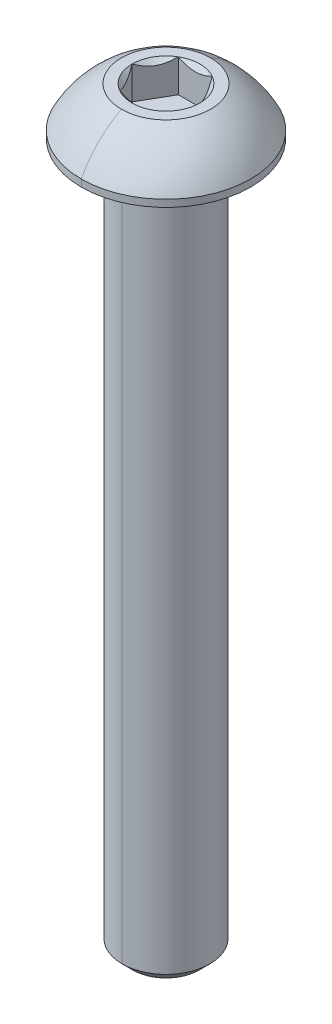
ISO-10303-21;
HEADER;
FILE_DESCRIPTION(('STEP AP214'),'2;1');
FILE_NAME('part.step','',(''),(''),'','','');
FILE_SCHEMA(('AUTOMOTIVE_DESIGN { 1 0 10303 214 1 1 1 1 }'));
ENDSEC;
DATA;
#1=APPLICATION_CONTEXT('core data for automotive mechanical design processes');
#2=APPLICATION_PROTOCOL_DEFINITION('international standard','automotive_design',2000,#1);
#3=PRODUCT_CONTEXT('',#1,'mechanical');
#4=PRODUCT('Part','Part','',(#3));
#5=PRODUCT_RELATED_PRODUCT_CATEGORY('part','',(#4));
#6=PRODUCT_DEFINITION_FORMATION('','',#4);
#7=PRODUCT_DEFINITION_CONTEXT('part definition',#1,'design');
#8=PRODUCT_DEFINITION('design','',#6,#7);
#9=PRODUCT_DEFINITION_SHAPE('','',#8);
#10=(LENGTH_UNIT() NAMED_UNIT(*) SI_UNIT(.MILLI.,.METRE.));
#11=(NAMED_UNIT(*) PLANE_ANGLE_UNIT() SI_UNIT($,.RADIAN.));
#12=(NAMED_UNIT(*) SI_UNIT($,.STERADIAN.) SOLID_ANGLE_UNIT());
#13=UNCERTAINTY_MEASURE_WITH_UNIT(LENGTH_MEASURE(1.E-05),#10,'distance_accuracy_value','');
#14=(GEOMETRIC_REPRESENTATION_CONTEXT(3) GLOBAL_UNCERTAINTY_ASSIGNED_CONTEXT((#13)) GLOBAL_UNIT_ASSIGNED_CONTEXT((#10,
#11,#12)) REPRESENTATION_CONTEXT('',''));
#15=CARTESIAN_POINT('',(0.,0.,0.));
#16=DIRECTION('',(0.,0.,1.));
#17=DIRECTION('',(1.,0.,0.));
#18=AXIS2_PLACEMENT_3D('',#15,#16,#17);
#19=CARTESIAN_POINT('',(0.,-0.152399999999997,0.));
#20=DIRECTION('',(0.,1.,0.));
#21=DIRECTION('',(0.,0.,1.));
#22=AXIS2_PLACEMENT_3D('',#19,#20,#21);
#23=TOROIDAL_SURFACE('',#22,2.5273,0.1524);
#24=CARTESIAN_POINT('',(0.,-0.152399999999997,-2.5273));
#25=DIRECTION('',(1.,0.,0.));
#26=DIRECTION('',(0.,0.,-1.));
#27=AXIS2_PLACEMENT_3D('',#24,#25,#26);
#28=CIRCLE('',#27,0.1524);
#29=CARTESIAN_POINT('',(0.,0.,-2.5273));
#30=VERTEX_POINT('',#29);
#31=CARTESIAN_POINT('',(0.,-0.152399999999997,-2.3749));
#32=VERTEX_POINT('',#31);
#33=EDGE_CURVE('E235',#30,#32,#28,.T.);
#34=ORIENTED_EDGE('',*,*,#33,.F.);
#35=CARTESIAN_POINT('',(0.,0.,0.));
#36=DIRECTION('',(0.,1.,0.));
#37=DIRECTION('',(0.,0.,1.));
#38=AXIS2_PLACEMENT_3D('',#35,#36,#37);
#39=CIRCLE('',#38,2.5273);
#40=CARTESIAN_POINT('',(0.,0.,2.5273));
#41=VERTEX_POINT('',#40);
#42=EDGE_CURVE('E229',#41,#30,#39,.T.);
#43=ORIENTED_EDGE('',*,*,#42,.F.);
#44=CARTESIAN_POINT('',(0.,-0.152399999999997,2.5273));
#45=DIRECTION('',(-1.,0.,0.));
#46=DIRECTION('',(0.,0.,1.));
#47=AXIS2_PLACEMENT_3D('',#44,#45,#46);
#48=CIRCLE('',#47,0.1524);
#49=CARTESIAN_POINT('',(0.,-0.152399999999997,2.3749));
#50=VERTEX_POINT('',#49);
#51=EDGE_CURVE('E255',#41,#50,#48,.T.);
#52=ORIENTED_EDGE('',*,*,#51,.T.);
#53=CARTESIAN_POINT('',(0.,-0.152399999999997,0.));
#54=DIRECTION('',(0.,-1.,0.));
#55=DIRECTION('',(0.,0.,1.));
#56=AXIS2_PLACEMENT_3D('',#53,#54,#55);
#57=CIRCLE('',#56,2.3749);
#58=EDGE_CURVE('E199',#32,#50,#57,.T.);
#59=ORIENTED_EDGE('',*,*,#58,.F.);
#60=EDGE_LOOP('',(#34,#43,#52,#59));
#61=FACE_BOUND('',#60,.T.);
#62=ADVANCED_FACE('F16',(#61),#23,.F.);
#63=CARTESIAN_POINT('',(0.,2.5654,0.));
#64=DIRECTION('',(0.,1.,0.));
#65=DIRECTION('',(0.,0.,1.));
#66=AXIS2_PLACEMENT_3D('',#63,#64,#65);
#67=CONICAL_SURFACE('',#66,1.83308710467706,0.78539816339745);
#68=DIRECTION('',(0.,0.707106781186546,-0.707106781186549));
#69=VECTOR('',#68,1.);
#70=CARTESIAN_POINT('',(0.,2.5654,-1.83308710467706));
#71=LINE('',#70,#69);
#72=CARTESIAN_POINT('',(0.,0.732312895322944,0.));
#73=VERTEX_POINT('',#72);
#74=CARTESIAN_POINT('',(0.,0.7874,-0.0550871046770556));
#75=VERTEX_POINT('',#74);
#76=EDGE_CURVE('E248',#73,#75,#71,.T.);
#77=ORIENTED_EDGE('',*,*,#76,.F.);
#78=DIRECTION('',(0.,0.707106781186546,0.707106781186549));
#79=VECTOR('',#78,1.);
#80=CARTESIAN_POINT('',(0.,2.5654,1.83308710467706));
#81=LINE('',#80,#79);
#82=CARTESIAN_POINT('',(0.,0.7874,0.0550871046770556));
#83=VERTEX_POINT('',#82);
#84=EDGE_CURVE('E252',#73,#83,#81,.T.);
#85=ORIENTED_EDGE('',*,*,#84,.T.);
#86=CARTESIAN_POINT('',(0.,0.7874,0.));
#87=DIRECTION('',(0.,1.,0.));
#88=DIRECTION('',(0.,0.,1.));
#89=AXIS2_PLACEMENT_3D('',#86,#87,#88);
#90=CIRCLE('',#89,0.0550871046770558);
#91=EDGE_CURVE('E220',#83,#75,#90,.T.);
#92=ORIENTED_EDGE('',*,*,#91,.T.);
#93=EDGE_LOOP('',(#77,#85,#92));
#94=FACE_BOUND('',#93,.T.);
#95=ADVANCED_FACE('F323',(#94),#67,.F.);
#96=CARTESIAN_POINT('',(1.83308710467706,0.7874,0.));
#97=DIRECTION('',(0.866025403784439,0.,-0.5));
#98=DIRECTION('',(0.,-1.,0.));
#99=AXIS2_PLACEMENT_3D('',#96,#97,#98);
#100=PLANE('',#99);
#101=DIRECTION('',(0.,1.,0.));
#102=VECTOR('',#101,1.);
#103=CARTESIAN_POINT('',(1.83308710467706,0.7874,0.));
#104=LINE('',#103,#102);
#105=CARTESIAN_POINT('',(1.83308710467706,0.7874,0.));
#106=VERTEX_POINT('',#105);
#107=CARTESIAN_POINT('',(1.83308710467706,2.5654,0.));
#108=VERTEX_POINT('',#107);
#109=EDGE_CURVE('E11',#106,#108,#104,.T.);
#110=ORIENTED_EDGE('',*,*,#109,.T.);
#111=CARTESIAN_POINT('',(1.83308710467706,2.5654,0.));
#112=CARTESIAN_POINT('',(1.58854939316106,2.32086228848399,-0.423551740712339));
#113=CARTESIAN_POINT('',(1.37650342717985,2.31981648546325,-0.790826127331817));
#114=CARTESIAN_POINT('',(1.16317917435944,2.31876437797812,-1.16031457170343));
#115=CARTESIAN_POINT('',(0.91654355233853,2.5654,-1.5875));
#116=B_SPLINE_CURVE_WITH_KNOTS('',2,(#111,#112,#113,#114,#115),.UNSPECIFIED.,.F.,.F.,(3,2,3),
(0.,0.5,1.),.UNSPECIFIED.);
#117=CARTESIAN_POINT('',(0.916543552338531,2.5654,-1.5875));
#118=VERTEX_POINT('',#117);
#119=EDGE_CURVE('E247',#108,#118,#116,.T.);
#120=ORIENTED_EDGE('',*,*,#119,.T.);
#121=DIRECTION('',(0.,1.,0.));
#122=VECTOR('',#121,1.);
#123=CARTESIAN_POINT('',(0.916543552338531,0.7874,-1.5875));
#124=LINE('',#123,#122);
#125=CARTESIAN_POINT('',(0.916543552338531,0.7874,-1.5875));
#126=VERTEX_POINT('',#125);
#127=EDGE_CURVE('E222',#126,#118,#124,.T.);
#128=ORIENTED_EDGE('',*,*,#127,.F.);
#129=DIRECTION('',(-0.5,0.,-0.866025403784439));
#130=VECTOR('',#129,1.);
#131=CARTESIAN_POINT('',(1.83308710467706,0.7874,0.));
#132=LINE('',#131,#130);
#133=EDGE_CURVE('E242',#106,#126,#132,.T.);
#134=ORIENTED_EDGE('',*,*,#133,.F.);
#135=EDGE_LOOP('',(#110,#120,#128,#134));
#136=FACE_BOUND('',#135,.T.);
#137=ADVANCED_FACE('F312',(#136),#100,.F.);
#138=CARTESIAN_POINT('',(0.916543552338531,0.7874,1.5875));
#139=DIRECTION('',(0.866025403784439,0.,0.5));
#140=DIRECTION('',(0.,-1.,0.));
#141=AXIS2_PLACEMENT_3D('',#138,#139,#140);
#142=PLANE('',#141);
#143=DIRECTION('',(0.,1.,0.));
#144=VECTOR('',#143,1.);
#145=CARTESIAN_POINT('',(0.916543552338531,0.7874,1.5875));
#146=LINE('',#145,#144);
#147=CARTESIAN_POINT('',(0.916543552338531,0.7874,1.5875));
#148=VERTEX_POINT('',#147);
#149=CARTESIAN_POINT('',(0.916543552338531,2.5654,1.5875));
#150=VERTEX_POINT('',#149);
#151=EDGE_CURVE('E29',#148,#150,#146,.T.);
#152=ORIENTED_EDGE('',*,*,#151,.T.);
#153=CARTESIAN_POINT('',(0.916543552338531,2.5654,1.5875));
#154=CARTESIAN_POINT('',(1.16108126385472,2.32086228848382,1.16394825928734));
#155=CARTESIAN_POINT('',(1.37312722983574,2.31981648546325,0.796673872668184));
#156=CARTESIAN_POINT('',(1.58645148265633,2.3187643779783,0.427185428296259));
#157=CARTESIAN_POINT('',(1.83308710467706,2.5654,0.));
#158=B_SPLINE_CURVE_WITH_KNOTS('',2,(#153,#154,#155,#156,#157),.UNSPECIFIED.,.F.,.F.,(3,2,3),
(0.,0.5,1.),.UNSPECIFIED.);
#159=EDGE_CURVE('E567',#150,#108,#158,.T.);
#160=ORIENTED_EDGE('',*,*,#159,.T.);
#161=ORIENTED_EDGE('',*,*,#109,.F.);
#162=DIRECTION('',(0.5,0.,-0.866025403784439));
#163=VECTOR('',#162,1.);
#164=CARTESIAN_POINT('',(0.916543552338531,0.7874,1.5875));
#165=LINE('',#164,#163);
#166=EDGE_CURVE('E223',#148,#106,#165,.T.);
#167=ORIENTED_EDGE('',*,*,#166,.F.);
#168=EDGE_LOOP('',(#152,#160,#161,#167));
#169=FACE_BOUND('',#168,.T.);
#170=ADVANCED_FACE('F322',(#169),#142,.F.);
#171=CARTESIAN_POINT('',(-0.91654355233853,0.7874,1.5875));
#172=DIRECTION('',(0.,0.,1.));
#173=DIRECTION('',(1.,0.,0.));
#174=AXIS2_PLACEMENT_3D('',#171,#172,#173);
#175=PLANE('',#174);
#176=DIRECTION('',(0.,1.,0.));
#177=VECTOR('',#176,1.);
#178=CARTESIAN_POINT('',(-0.91654355233853,0.7874,1.5875));
#179=LINE('',#178,#177);
#180=CARTESIAN_POINT('',(-0.91654355233853,0.7874,1.5875));
#181=VERTEX_POINT('',#180);
#182=CARTESIAN_POINT('',(-0.91654355233853,2.5654,1.5875));
#183=VERTEX_POINT('',#182);
#184=EDGE_CURVE('E451',#181,#183,#179,.T.);
#185=ORIENTED_EDGE('',*,*,#184,.T.);
#186=CARTESIAN_POINT('',(-0.916543552338531,2.5654,1.5875));
#187=CARTESIAN_POINT('',(-0.684381010738564,2.44931872920002,1.5875));
#188=CARTESIAN_POINT('',(-0.4718738638875,2.38845938444161,1.5875));
#189=CARTESIAN_POINT('',(-0.232175759974894,2.31981289532294,1.5875));
#190=CARTESIAN_POINT('',(0.,2.31981289532294,1.5875));
#191=B_SPLINE_CURVE_WITH_KNOTS('',2,(#186,#187,#188,#189,#190),.UNSPECIFIED.,.F.,.F.,(3,2,3),
(0.,0.5,1.),.UNSPECIFIED.);
#192=CARTESIAN_POINT('',(0.,2.31981289532294,1.5875));
#193=VERTEX_POINT('',#192);
#194=EDGE_CURVE('E447',#183,#193,#191,.T.);
#195=ORIENTED_EDGE('',*,*,#194,.T.);
#196=CARTESIAN_POINT('',(0.,2.31981289532294,1.5875));
#197=CARTESIAN_POINT('',(0.229732695645398,2.31981289532294,1.5875));
#198=CARTESIAN_POINT('',(0.471961624215038,2.3884843914945,1.5875));
#199=CARTESIAN_POINT('',(0.68154594324368,2.44790119545257,1.5875));
#200=CARTESIAN_POINT('',(0.91654355233853,2.5654,1.5875));
#201=B_SPLINE_CURVE_WITH_KNOTS('',2,(#196,#197,#198,#199,#200),.UNSPECIFIED.,.F.,.F.,(3,2,3),
(0.,0.5,1.),.UNSPECIFIED.);
#202=EDGE_CURVE('E417',#193,#150,#201,.T.);
#203=ORIENTED_EDGE('',*,*,#202,.T.);
#204=ORIENTED_EDGE('',*,*,#151,.F.);
#205=DIRECTION('',(1.,0.,0.));
#206=VECTOR('',#205,1.);
#207=CARTESIAN_POINT('',(-0.91654355233853,0.7874,1.5875));
#208=LINE('',#207,#206);
#209=EDGE_CURVE('E260',#181,#148,#208,.T.);
#210=ORIENTED_EDGE('',*,*,#209,.F.);
#211=EDGE_LOOP('',(#185,#195,#203,#204,#210));
#212=FACE_BOUND('',#211,.T.);
#213=ADVANCED_FACE('F344',(#212),#175,.F.);
#214=CARTESIAN_POINT('',(-1.83308710467706,0.7874,0.));
#215=DIRECTION('',(-0.866025403784439,0.,0.5));
#216=DIRECTION('',(0.,1.,0.));
#217=AXIS2_PLACEMENT_3D('',#214,#215,#216);
#218=PLANE('',#217);
#219=DIRECTION('',(0.,1.,0.));
#220=VECTOR('',#219,1.);
#221=CARTESIAN_POINT('',(-1.83308710467706,0.7874,0.));
#222=LINE('',#221,#220);
#223=CARTESIAN_POINT('',(-1.83308710467706,0.7874,0.));
#224=VERTEX_POINT('',#223);
#225=CARTESIAN_POINT('',(-1.83308710467706,2.5654,0.));
#226=VERTEX_POINT('',#225);
#227=EDGE_CURVE('E370',#224,#226,#222,.T.);
#228=ORIENTED_EDGE('',*,*,#227,.T.);
#229=CARTESIAN_POINT('',(-1.83308710467706,2.5654,0.));
#230=CARTESIAN_POINT('',(-1.58854939316106,2.32086228848399,0.423551740712331));
#231=CARTESIAN_POINT('',(-1.37650342717985,2.31981648546325,0.790826127331817));
#232=CARTESIAN_POINT('',(-1.16317917435944,2.31876437797812,1.16031457170343));
#233=CARTESIAN_POINT('',(-0.91654355233853,2.5654,1.5875));
#234=B_SPLINE_CURVE_WITH_KNOTS('',2,(#229,#230,#231,#232,#233),.UNSPECIFIED.,.F.,.F.,(3,2,3),
(0.,0.5,1.),.UNSPECIFIED.);
#235=EDGE_CURVE('E364',#226,#183,#234,.T.);
#236=ORIENTED_EDGE('',*,*,#235,.T.);
#237=ORIENTED_EDGE('',*,*,#184,.F.);
#238=DIRECTION('',(0.5,0.,0.866025403784438));
#239=VECTOR('',#238,1.);
#240=CARTESIAN_POINT('',(-1.83308710467706,0.7874,0.));
#241=LINE('',#240,#239);
#242=EDGE_CURVE('E256',#224,#181,#241,.T.);
#243=ORIENTED_EDGE('',*,*,#242,.F.);
#244=EDGE_LOOP('',(#228,#236,#237,#243));
#245=FACE_BOUND('',#244,.T.);
#246=ADVANCED_FACE('F340',(#245),#218,.F.);
#247=CARTESIAN_POINT('',(-0.916543552338531,0.7874,-1.5875));
#248=DIRECTION('',(-0.866025403784439,0.,-0.5));
#249=DIRECTION('',(-0.5,0.,0.866025403784439));
#250=AXIS2_PLACEMENT_3D('',#247,#248,#249);
#251=PLANE('',#250);
#252=DIRECTION('',(0.,1.,0.));
#253=VECTOR('',#252,1.);
#254=CARTESIAN_POINT('',(-0.916543552338531,0.7874,-1.5875));
#255=LINE('',#254,#253);
#256=CARTESIAN_POINT('',(-0.916543552338531,0.7874,-1.5875));
#257=VERTEX_POINT('',#256);
#258=CARTESIAN_POINT('',(-0.916543552338531,2.5654,-1.5875));
#259=VERTEX_POINT('',#258);
#260=EDGE_CURVE('E499',#257,#259,#255,.T.);
#261=ORIENTED_EDGE('',*,*,#260,.T.);
#262=CARTESIAN_POINT('',(-0.916543552338531,2.5654,-1.5875));
#263=CARTESIAN_POINT('',(-1.16108126385453,2.320862288484,-1.16394825928767));
#264=CARTESIAN_POINT('',(-1.37312722983574,2.31981648546325,-0.796673872668183));
#265=CARTESIAN_POINT('',(-1.58645148265615,2.31876437797813,-0.427185428296571));
#266=CARTESIAN_POINT('',(-1.83308710467706,2.5654,0.));
#267=B_SPLINE_CURVE_WITH_KNOTS('',2,(#262,#263,#264,#265,#266),.UNSPECIFIED.,.F.,.F.,(3,2,3),
(0.,0.5,1.),.UNSPECIFIED.);
#268=EDGE_CURVE('E597',#259,#226,#267,.T.);
#269=ORIENTED_EDGE('',*,*,#268,.T.);
#270=ORIENTED_EDGE('',*,*,#227,.F.);
#271=DIRECTION('',(-0.5,0.,0.866025403784439));
#272=VECTOR('',#271,1.);
#273=CARTESIAN_POINT('',(-0.916543552338531,0.7874,-1.5875));
#274=LINE('',#273,#272);
#275=EDGE_CURVE('E261',#257,#224,#274,.T.);
#276=ORIENTED_EDGE('',*,*,#275,.F.);
#277=EDGE_LOOP('',(#261,#269,#270,#276));
#278=FACE_BOUND('',#277,.T.);
#279=ADVANCED_FACE('F343',(#278),#251,.F.);
#280=CARTESIAN_POINT('',(0.916543552338531,0.7874,-1.5875));
#281=DIRECTION('',(0.,0.,-1.));
#282=DIRECTION('',(-1.,0.,0.));
#283=AXIS2_PLACEMENT_3D('',#280,#281,#282);
#284=PLANE('',#283);
#285=ORIENTED_EDGE('',*,*,#127,.T.);
#286=CARTESIAN_POINT('',(0.916543552338531,2.5654,-1.5875));
#287=CARTESIAN_POINT('',(0.68330023814449,2.44877834290298,-1.5875));
#288=CARTESIAN_POINT('',(0.472022049766507,2.38850161206546,-1.5875));
#289=CARTESIAN_POINT('',(0.231606862063275,2.31991222444484,-1.5875));
#290=CARTESIAN_POINT('',(0.000126990617285933,2.31981290040219,-1.5875));
#291=CARTESIAN_POINT('',(-0.230319895797069,2.3197140195957,-1.5875));
#292=CARTESIAN_POINT('',(-0.471813597713689,2.38844221424328,-1.5875));
#293=CARTESIAN_POINT('',(-0.682613944360854,2.44843519601116,-1.5875));
#294=CARTESIAN_POINT('',(-0.916543552338529,2.5654,-1.5875));
#295=B_SPLINE_CURVE_WITH_KNOTS('',2,(#286,#287,#288,#289,#290,#291,#292,#293,#294),
.UNSPECIFIED.,.F.,.F.,(3,2,2,2,3),(0.,0.25,0.5,0.75,1.),.UNSPECIFIED.);
#296=EDGE_CURVE('E502',#118,#259,#295,.T.);
#297=ORIENTED_EDGE('',*,*,#296,.T.);
#298=ORIENTED_EDGE('',*,*,#260,.F.);
#299=DIRECTION('',(-1.,0.,0.));
#300=VECTOR('',#299,1.);
#301=CARTESIAN_POINT('',(0.916543552338531,0.7874,-1.5875));
#302=LINE('',#301,#300);
#303=EDGE_CURVE('E246',#126,#257,#302,.T.);
#304=ORIENTED_EDGE('',*,*,#303,.F.);
#305=EDGE_LOOP('',(#285,#297,#298,#304));
#306=FACE_BOUND('',#305,.T.);
#307=ADVANCED_FACE('F324',(#306),#284,.F.);
#308=CARTESIAN_POINT('',(0.,0.7874,0.));
#309=DIRECTION('',(0.,1.,0.));
#310=DIRECTION('',(1.,0.,0.));
#311=AXIS2_PLACEMENT_3D('',#308,#309,#310);
#312=PLANE('',#311);
#313=ORIENTED_EDGE('',*,*,#91,.F.);
#314=CARTESIAN_POINT('',(0.,0.7874,0.));
#315=DIRECTION('',(0.,1.,0.));
#316=DIRECTION('',(0.,0.,1.));
#317=AXIS2_PLACEMENT_3D('',#314,#315,#316);
#318=CIRCLE('',#317,0.0550871046770558);
#319=EDGE_CURVE('E219',#75,#83,#318,.T.);
#320=ORIENTED_EDGE('',*,*,#319,.F.);
#321=EDGE_LOOP('',(#313,#320));
#322=FACE_BOUND('',#321,.T.);
#323=ORIENTED_EDGE('',*,*,#133,.T.);
#324=ORIENTED_EDGE('',*,*,#303,.T.);
#325=ORIENTED_EDGE('',*,*,#275,.T.);
#326=ORIENTED_EDGE('',*,*,#242,.T.);
#327=ORIENTED_EDGE('',*,*,#209,.T.);
#328=ORIENTED_EDGE('',*,*,#166,.T.);
#329=EDGE_LOOP('',(#323,#324,#325,#326,#327,#328));
#330=FACE_BOUND('',#329,.T.);
#331=ADVANCED_FACE('F488',(#322,#330),#312,.T.);
#332=CARTESIAN_POINT('',(0.,2.5654,0.));
#333=DIRECTION('',(0.,1.,0.));
#334=DIRECTION('',(0.,0.,1.));
#335=AXIS2_PLACEMENT_3D('',#332,#333,#334);
#336=CONICAL_SURFACE('',#335,1.83308710467706,0.78539816339745);
#337=CARTESIAN_POINT('',(0.,2.5654,0.));
#338=DIRECTION('',(0.,1.,0.));
#339=DIRECTION('',(0.,0.,1.));
#340=AXIS2_PLACEMENT_3D('',#337,#338,#339);
#341=CIRCLE('',#340,1.83308710467706);
#342=EDGE_CURVE('E646',#108,#118,#341,.T.);
#343=ORIENTED_EDGE('',*,*,#342,.T.);
#344=ORIENTED_EDGE('',*,*,#119,.F.);
#345=EDGE_LOOP('',(#343,#344));
#346=FACE_BOUND('',#345,.T.);
#347=ADVANCED_FACE('F401',(#346),#336,.F.);
#348=CARTESIAN_POINT('',(0.,2.5654,0.));
#349=DIRECTION('',(0.,1.,0.));
#350=DIRECTION('',(0.,0.,1.));
#351=AXIS2_PLACEMENT_3D('',#348,#349,#350);
#352=CONICAL_SURFACE('',#351,1.83308710467706,0.78539816339745);
#353=CARTESIAN_POINT('',(0.,2.5654,0.));
#354=DIRECTION('',(0.,1.,0.));
#355=DIRECTION('',(0.,0.,1.));
#356=AXIS2_PLACEMENT_3D('',#353,#354,#355);
#357=CIRCLE('',#356,1.83308710467706);
#358=EDGE_CURVE('E635',#150,#108,#357,.T.);
#359=ORIENTED_EDGE('',*,*,#358,.T.);
#360=ORIENTED_EDGE('',*,*,#159,.F.);
#361=EDGE_LOOP('',(#359,#360));
#362=FACE_BOUND('',#361,.T.);
#363=ADVANCED_FACE('F460',(#362),#352,.F.);
#364=CARTESIAN_POINT('',(0.,2.5654,0.));
#365=DIRECTION('',(0.,1.,0.));
#366=DIRECTION('',(0.,0.,1.));
#367=AXIS2_PLACEMENT_3D('',#364,#365,#366);
#368=CONICAL_SURFACE('',#367,1.83308710467706,0.78539816339745);
#369=DIRECTION('',(0.,0.707106781186546,0.707106781186549));
#370=VECTOR('',#369,1.);
#371=CARTESIAN_POINT('',(0.,2.5654,1.83308710467706));
#372=LINE('',#371,#370);
#373=CARTESIAN_POINT('',(0.,2.5654,1.83308710467706));
#374=VERTEX_POINT('',#373);
#375=EDGE_CURVE('E468',#193,#374,#372,.T.);
#376=ORIENTED_EDGE('',*,*,#375,.F.);
#377=ORIENTED_EDGE('',*,*,#194,.F.);
#378=CARTESIAN_POINT('',(0.,2.5654,0.));
#379=DIRECTION('',(0.,1.,0.));
#380=DIRECTION('',(0.,0.,1.));
#381=AXIS2_PLACEMENT_3D('',#378,#379,#380);
#382=CIRCLE('',#381,1.83308710467706);
#383=EDGE_CURVE('E470',#183,#374,#382,.T.);
#384=ORIENTED_EDGE('',*,*,#383,.T.);
#385=EDGE_LOOP('',(#376,#377,#384));
#386=FACE_BOUND('',#385,.T.);
#387=ADVANCED_FACE('F381',(#386),#368,.F.);
#388=CARTESIAN_POINT('',(0.,2.5654,0.));
#389=DIRECTION('',(0.,1.,0.));
#390=DIRECTION('',(0.,0.,1.));
#391=AXIS2_PLACEMENT_3D('',#388,#389,#390);
#392=CONICAL_SURFACE('',#391,1.83308710467706,0.78539816339745);
#393=CARTESIAN_POINT('',(0.,2.5654,0.));
#394=DIRECTION('',(0.,1.,0.));
#395=DIRECTION('',(0.,0.,1.));
#396=AXIS2_PLACEMENT_3D('',#393,#394,#395);
#397=CIRCLE('',#396,1.83308710467706);
#398=EDGE_CURVE('E624',#226,#183,#397,.T.);
#399=ORIENTED_EDGE('',*,*,#398,.T.);
#400=ORIENTED_EDGE('',*,*,#235,.F.);
#401=EDGE_LOOP('',(#399,#400));
#402=FACE_BOUND('',#401,.T.);
#403=ADVANCED_FACE('F372',(#402),#392,.F.);
#404=CARTESIAN_POINT('',(0.,2.5654,0.));
#405=DIRECTION('',(0.,1.,0.));
#406=DIRECTION('',(0.,0.,1.));
#407=AXIS2_PLACEMENT_3D('',#404,#405,#406);
#408=CONICAL_SURFACE('',#407,1.83308710467706,0.78539816339745);
#409=CARTESIAN_POINT('',(0.,2.5654,0.));
#410=DIRECTION('',(0.,1.,0.));
#411=DIRECTION('',(0.,0.,1.));
#412=AXIS2_PLACEMENT_3D('',#409,#410,#411);
#413=CIRCLE('',#412,1.83308710467706);
#414=EDGE_CURVE('E614',#259,#226,#413,.T.);
#415=ORIENTED_EDGE('',*,*,#414,.T.);
#416=ORIENTED_EDGE('',*,*,#268,.F.);
#417=EDGE_LOOP('',(#415,#416));
#418=FACE_BOUND('',#417,.T.);
#419=ADVANCED_FACE('F346',(#418),#408,.F.);
#420=CARTESIAN_POINT('',(0.,2.5654,0.));
#421=DIRECTION('',(0.,1.,0.));
#422=DIRECTION('',(0.,0.,1.));
#423=AXIS2_PLACEMENT_3D('',#420,#421,#422);
#424=CONICAL_SURFACE('',#423,1.83308710467706,0.78539816339745);
#425=CARTESIAN_POINT('',(0.,2.5654,0.));
#426=DIRECTION('',(0.,1.,0.));
#427=DIRECTION('',(0.,0.,1.));
#428=AXIS2_PLACEMENT_3D('',#425,#426,#427);
#429=CIRCLE('',#428,1.83308710467706);
#430=EDGE_CURVE('E241',#118,#259,#429,.T.);
#431=ORIENTED_EDGE('',*,*,#430,.T.);
#432=ORIENTED_EDGE('',*,*,#296,.F.);
#433=EDGE_LOOP('',(#431,#432));
#434=FACE_BOUND('',#433,.T.);
#435=ADVANCED_FACE('F395',(#434),#424,.F.);
#436=CARTESIAN_POINT('',(0.,2.5654,-2.413));
#437=DIRECTION('',(0.,-1.,0.));
#438=DIRECTION('',(0.,0.,-1.));
#439=AXIS2_PLACEMENT_3D('',#436,#437,#438);
#440=PLANE('',#439);
#441=ORIENTED_EDGE('',*,*,#430,.F.);
#442=ORIENTED_EDGE('',*,*,#342,.F.);
#443=ORIENTED_EDGE('',*,*,#358,.F.);
#444=CARTESIAN_POINT('',(0.,2.5654,0.));
#445=DIRECTION('',(0.,1.,0.));
#446=DIRECTION('',(0.,0.,1.));
#447=AXIS2_PLACEMENT_3D('',#444,#445,#446);
#448=CIRCLE('',#447,1.83308710467706);
#449=EDGE_CURVE('E474',#374,#150,#448,.T.);
#450=ORIENTED_EDGE('',*,*,#449,.F.);
#451=ORIENTED_EDGE('',*,*,#383,.F.);
#452=ORIENTED_EDGE('',*,*,#398,.F.);
#453=ORIENTED_EDGE('',*,*,#414,.F.);
#454=EDGE_LOOP('',(#441,#442,#443,#450,#451,#452,#453));
#455=FACE_BOUND('',#454,.T.);
#456=CARTESIAN_POINT('',(0.,2.5654,0.));
#457=DIRECTION('',(0.,1.,0.));
#458=DIRECTION('',(0.,0.,1.));
#459=AXIS2_PLACEMENT_3D('',#456,#457,#458);
#460=CIRCLE('',#459,2.413);
#461=CARTESIAN_POINT('',(0.,2.5654,2.413));
#462=VERTEX_POINT('',#461);
#463=CARTESIAN_POINT('',(0.,2.5654,-2.413));
#464=VERTEX_POINT('',#463);
#465=EDGE_CURVE('E230',#462,#464,#460,.T.);
#466=ORIENTED_EDGE('',*,*,#465,.T.);
#467=CARTESIAN_POINT('',(0.,2.5654,0.));
#468=DIRECTION('',(0.,1.,0.));
#469=DIRECTION('',(0.,0.,1.));
#470=AXIS2_PLACEMENT_3D('',#467,#468,#469);
#471=CIRCLE('',#470,2.413);
#472=EDGE_CURVE('E149',#464,#462,#471,.T.);
#473=ORIENTED_EDGE('',*,*,#472,.T.);
#474=EDGE_LOOP('',(#466,#473));
#475=FACE_BOUND('',#474,.T.);
#476=ADVANCED_FACE('F399',(#455,#475),#440,.F.);
#477=CARTESIAN_POINT('',(0.,-1.9398474797777,0.));
#478=DIRECTION('',(0.,1.,0.));
#479=DIRECTION('',(0.,0.,1.));
#480=AXIS2_PLACEMENT_3D('',#477,#478,#479);
#481=DEGENERATE_TOROIDAL_SURFACE('',#480,0.065843178235288,5.08,.T.);
#482=CARTESIAN_POINT('',(0.,-1.9398474797777,-0.065843178235288));
#483=DIRECTION('',(1.,0.,0.));
#484=DIRECTION('',(0.,0.,-1.));
#485=AXIS2_PLACEMENT_3D('',#482,#483,#484);
#486=CIRCLE('',#485,5.08);
#487=CARTESIAN_POINT('',(0.,0.381,-4.5847));
#488=VERTEX_POINT('',#487);
#489=EDGE_CURVE('E234',#488,#464,#486,.T.);
#490=ORIENTED_EDGE('',*,*,#489,.F.);
#491=CARTESIAN_POINT('',(0.,0.381,0.));
#492=DIRECTION('',(0.,1.,0.));
#493=DIRECTION('',(0.,0.,1.));
#494=AXIS2_PLACEMENT_3D('',#491,#492,#493);
#495=CIRCLE('',#494,4.5847);
#496=CARTESIAN_POINT('',(0.,0.381,4.5847));
#497=VERTEX_POINT('',#496);
#498=EDGE_CURVE('E137',#488,#497,#495,.T.);
#499=ORIENTED_EDGE('',*,*,#498,.T.);
#500=CARTESIAN_POINT('',(0.,-1.9398474797777,0.065843178235288));
#501=DIRECTION('',(-1.,0.,0.));
#502=DIRECTION('',(0.,0.,1.));
#503=AXIS2_PLACEMENT_3D('',#500,#501,#502);
#504=CIRCLE('',#503,5.08);
#505=EDGE_CURVE('E233',#497,#462,#504,.T.);
#506=ORIENTED_EDGE('',*,*,#505,.T.);
#507=ORIENTED_EDGE('',*,*,#472,.F.);
#508=EDGE_LOOP('',(#490,#499,#506,#507));
#509=FACE_BOUND('',#508,.T.);
#510=ADVANCED_FACE('F18',(#509),#481,.T.);
#511=CARTESIAN_POINT('',(0.,2.5654,0.));
#512=DIRECTION('',(0.,1.,0.));
#513=DIRECTION('',(0.,0.,1.));
#514=AXIS2_PLACEMENT_3D('',#511,#512,#513);
#515=CYLINDRICAL_SURFACE('',#514,4.5847);
#516=DIRECTION('',(0.,1.,0.));
#517=VECTOR('',#516,1.);
#518=CARTESIAN_POINT('',(0.,2.5654,-4.5847));
#519=LINE('',#518,#517);
#520=CARTESIAN_POINT('',(0.,0.,-4.5847));
#521=VERTEX_POINT('',#520);
#522=EDGE_CURVE('E277',#521,#488,#519,.T.);
#523=ORIENTED_EDGE('',*,*,#522,.F.);
#524=CARTESIAN_POINT('',(0.,0.,0.));
#525=DIRECTION('',(0.,1.,0.));
#526=DIRECTION('',(0.,0.,1.));
#527=AXIS2_PLACEMENT_3D('',#524,#525,#526);
#528=CIRCLE('',#527,4.5847);
#529=CARTESIAN_POINT('',(0.,0.,4.5847));
#530=VERTEX_POINT('',#529);
#531=EDGE_CURVE('E281',#521,#530,#528,.T.);
#532=ORIENTED_EDGE('',*,*,#531,.T.);
#533=DIRECTION('',(0.,1.,0.));
#534=VECTOR('',#533,1.);
#535=CARTESIAN_POINT('',(0.,2.5654,4.5847));
#536=LINE('',#535,#534);
#537=EDGE_CURVE('E215',#530,#497,#536,.T.);
#538=ORIENTED_EDGE('',*,*,#537,.T.);
#539=ORIENTED_EDGE('',*,*,#498,.F.);
#540=EDGE_LOOP('',(#523,#532,#538,#539));
#541=FACE_BOUND('',#540,.T.);
#542=ADVANCED_FACE('F327',(#541),#515,.T.);
#543=CARTESIAN_POINT('',(0.,0.,0.));
#544=DIRECTION('',(0.,1.,0.));
#545=DIRECTION('',(1.,0.,0.));
#546=AXIS2_PLACEMENT_3D('',#543,#544,#545);
#547=PLANE('',#546);
#548=ORIENTED_EDGE('',*,*,#42,.T.);
#549=CARTESIAN_POINT('',(0.,0.,0.));
#550=DIRECTION('',(0.,1.,0.));
#551=DIRECTION('',(0.,0.,1.));
#552=AXIS2_PLACEMENT_3D('',#549,#550,#551);
#553=CIRCLE('',#552,2.5273);
#554=EDGE_CURVE('E238',#30,#41,#553,.T.);
#555=ORIENTED_EDGE('',*,*,#554,.T.);
#556=EDGE_LOOP('',(#548,#555));
#557=FACE_BOUND('',#556,.T.);
#558=CARTESIAN_POINT('',(0.,0.,0.));
#559=DIRECTION('',(0.,1.,0.));
#560=DIRECTION('',(0.,0.,1.));
#561=AXIS2_PLACEMENT_3D('',#558,#559,#560);
#562=CIRCLE('',#561,4.5847);
#563=EDGE_CURVE('E274',#530,#521,#562,.T.);
#564=ORIENTED_EDGE('',*,*,#563,.F.);
#565=ORIENTED_EDGE('',*,*,#531,.F.);
#566=EDGE_LOOP('',(#564,#565));
#567=FACE_BOUND('',#566,.T.);
#568=ADVANCED_FACE('F330',(#557,#567),#547,.F.);
#569=CARTESIAN_POINT('',(0.,-37.5158,0.));
#570=DIRECTION('',(0.,1.,0.));
#571=DIRECTION('',(0.,0.,1.));
#572=AXIS2_PLACEMENT_3D('',#569,#570,#571);
#573=CONICAL_SURFACE('',#572,2.3749,0.785398163397453);
#574=DIRECTION('',(0.,0.707106781186545,-0.707106781186551));
#575=VECTOR('',#574,1.);
#576=CARTESIAN_POINT('',(0.,-37.5158,-2.3749));
#577=LINE('',#576,#575);
#578=CARTESIAN_POINT('',(0.,-38.1,-1.7907));
#579=VERTEX_POINT('',#578);
#580=CARTESIAN_POINT('',(0.,-37.5158,-2.3749));
#581=VERTEX_POINT('',#580);
#582=EDGE_CURVE('E177',#579,#581,#577,.T.);
#583=ORIENTED_EDGE('',*,*,#582,.F.);
#584=CARTESIAN_POINT('',(0.,-38.1,0.));
#585=DIRECTION('',(0.,-1.,0.));
#586=DIRECTION('',(0.,0.,1.));
#587=AXIS2_PLACEMENT_3D('',#584,#585,#586);
#588=CIRCLE('',#587,1.7907);
#589=CARTESIAN_POINT('',(0.,-38.1,1.7907));
#590=VERTEX_POINT('',#589);
#591=EDGE_CURVE('E185',#590,#579,#588,.T.);
#592=ORIENTED_EDGE('',*,*,#591,.F.);
#593=DIRECTION('',(0.,0.707106781186545,0.707106781186551));
#594=VECTOR('',#593,1.);
#595=CARTESIAN_POINT('',(0.,-37.5158,2.3749));
#596=LINE('',#595,#594);
#597=CARTESIAN_POINT('',(0.,-37.5158,2.3749));
#598=VERTEX_POINT('',#597);
#599=EDGE_CURVE('E180',#590,#598,#596,.T.);
#600=ORIENTED_EDGE('',*,*,#599,.T.);
#601=CARTESIAN_POINT('',(0.,-37.5158,0.));
#602=DIRECTION('',(0.,1.,0.));
#603=DIRECTION('',(0.,0.,1.));
#604=AXIS2_PLACEMENT_3D('',#601,#602,#603);
#605=CIRCLE('',#604,2.3749);
#606=EDGE_CURVE('E173',#581,#598,#605,.T.);
#607=ORIENTED_EDGE('',*,*,#606,.F.);
#608=EDGE_LOOP('',(#583,#592,#600,#607));
#609=FACE_BOUND('',#608,.T.);
#610=ADVANCED_FACE('F175',(#609),#573,.T.);
#611=CARTESIAN_POINT('',(0.,-38.1,0.));
#612=DIRECTION('',(0.,1.,0.));
#613=DIRECTION('',(1.,0.,0.));
#614=AXIS2_PLACEMENT_3D('',#611,#612,#613);
#615=PLANE('',#614);
#616=ORIENTED_EDGE('',*,*,#591,.T.);
#617=CARTESIAN_POINT('',(0.,-38.1,0.));
#618=DIRECTION('',(0.,-1.,0.));
#619=DIRECTION('',(0.,0.,1.));
#620=AXIS2_PLACEMENT_3D('',#617,#618,#619);
#621=CIRCLE('',#620,1.7907);
#622=EDGE_CURVE('E208',#579,#590,#621,.T.);
#623=ORIENTED_EDGE('',*,*,#622,.T.);
#624=EDGE_LOOP('',(#616,#623));
#625=FACE_BOUND('',#624,.T.);
#626=ADVANCED_FACE('F388',(#625),#615,.F.);
#627=CARTESIAN_POINT('',(0.,-38.1,0.));
#628=DIRECTION('',(0.,1.,0.));
#629=DIRECTION('',(0.,0.,1.));
#630=AXIS2_PLACEMENT_3D('',#627,#628,#629);
#631=CYLINDRICAL_SURFACE('',#630,2.3749);
#632=DIRECTION('',(0.,1.,0.));
#633=VECTOR('',#632,1.);
#634=CARTESIAN_POINT('',(0.,-38.1,-2.3749));
#635=LINE('',#634,#633);
#636=EDGE_CURVE('E190',#581,#32,#635,.T.);
#637=ORIENTED_EDGE('',*,*,#636,.F.);
#638=ORIENTED_EDGE('',*,*,#606,.T.);
#639=DIRECTION('',(0.,1.,0.));
#640=VECTOR('',#639,1.);
#641=CARTESIAN_POINT('',(0.,-38.1,2.3749));
#642=LINE('',#641,#640);
#643=EDGE_CURVE('E186',#598,#50,#642,.T.);
#644=ORIENTED_EDGE('',*,*,#643,.T.);
#645=CARTESIAN_POINT('',(0.,-0.152399999999997,0.));
#646=DIRECTION('',(0.,-1.,0.));
#647=DIRECTION('',(0.,0.,1.));
#648=AXIS2_PLACEMENT_3D('',#645,#646,#647);
#649=CIRCLE('',#648,2.3749);
#650=EDGE_CURVE('E194',#50,#32,#649,.T.);
#651=ORIENTED_EDGE('',*,*,#650,.T.);
#652=EDGE_LOOP('',(#637,#638,#644,#651));
#653=FACE_BOUND('',#652,.T.);
#654=ADVANCED_FACE('F192',(#653),#631,.T.);
#655=CARTESIAN_POINT('',(0.,-38.1,0.));
#656=DIRECTION('',(0.,1.,0.));
#657=DIRECTION('',(0.,0.,1.));
#658=AXIS2_PLACEMENT_3D('',#655,#656,#657);
#659=CYLINDRICAL_SURFACE('',#658,2.3749);
#660=CARTESIAN_POINT('',(0.,-37.5158,0.));
#661=DIRECTION('',(0.,1.,0.));
#662=DIRECTION('',(0.,0.,1.));
#663=AXIS2_PLACEMENT_3D('',#660,#661,#662);
#664=CIRCLE('',#663,2.3749);
#665=EDGE_CURVE('E201',#598,#581,#664,.T.);
#666=ORIENTED_EDGE('',*,*,#665,.T.);
#667=ORIENTED_EDGE('',*,*,#636,.T.);
#668=ORIENTED_EDGE('',*,*,#58,.T.);
#669=ORIENTED_EDGE('',*,*,#643,.F.);
#670=EDGE_LOOP('',(#666,#667,#668,#669));
#671=FACE_BOUND('',#670,.T.);
#672=ADVANCED_FACE('F202',(#671),#659,.T.);
#673=CARTESIAN_POINT('',(0.,-37.5158,0.));
#674=DIRECTION('',(0.,1.,0.));
#675=DIRECTION('',(0.,0.,1.));
#676=AXIS2_PLACEMENT_3D('',#673,#674,#675);
#677=CONICAL_SURFACE('',#676,2.3749,0.785398163397453);
#678=ORIENTED_EDGE('',*,*,#622,.F.);
#679=ORIENTED_EDGE('',*,*,#582,.T.);
#680=ORIENTED_EDGE('',*,*,#665,.F.);
#681=ORIENTED_EDGE('',*,*,#599,.F.);
#682=EDGE_LOOP('',(#678,#679,#680,#681));
#683=FACE_BOUND('',#682,.T.);
#684=ADVANCED_FACE('F206',(#683),#677,.T.);
#685=CARTESIAN_POINT('',(0.,2.5654,0.));
#686=DIRECTION('',(0.,1.,0.));
#687=DIRECTION('',(0.,0.,1.));
#688=AXIS2_PLACEMENT_3D('',#685,#686,#687);
#689=CYLINDRICAL_SURFACE('',#688,4.5847);
#690=ORIENTED_EDGE('',*,*,#563,.T.);
#691=ORIENTED_EDGE('',*,*,#522,.T.);
#692=CARTESIAN_POINT('',(0.,0.381,0.));
#693=DIRECTION('',(0.,1.,0.));
#694=DIRECTION('',(0.,0.,1.));
#695=AXIS2_PLACEMENT_3D('',#692,#693,#694);
#696=CIRCLE('',#695,4.5847);
#697=EDGE_CURVE('E273',#497,#488,#696,.T.);
#698=ORIENTED_EDGE('',*,*,#697,.F.);
#699=ORIENTED_EDGE('',*,*,#537,.F.);
#700=EDGE_LOOP('',(#690,#691,#698,#699));
#701=FACE_BOUND('',#700,.T.);
#702=ADVANCED_FACE('F530',(#701),#689,.T.);
#703=CARTESIAN_POINT('',(0.,-1.9398474797777,0.));
#704=DIRECTION('',(0.,1.,0.));
#705=DIRECTION('',(0.,0.,1.));
#706=AXIS2_PLACEMENT_3D('',#703,#704,#705);
#707=DEGENERATE_TOROIDAL_SURFACE('',#706,0.065843178235288,5.08,.T.);
#708=ORIENTED_EDGE('',*,*,#697,.T.);
#709=ORIENTED_EDGE('',*,*,#489,.T.);
#710=ORIENTED_EDGE('',*,*,#465,.F.);
#711=ORIENTED_EDGE('',*,*,#505,.F.);
#712=EDGE_LOOP('',(#708,#709,#710,#711));
#713=FACE_BOUND('',#712,.T.);
#714=ADVANCED_FACE('F386',(#713),#707,.T.);
#715=CARTESIAN_POINT('',(0.,2.5654,0.));
#716=DIRECTION('',(0.,1.,0.));
#717=DIRECTION('',(0.,0.,1.));
#718=AXIS2_PLACEMENT_3D('',#715,#716,#717);
#719=CONICAL_SURFACE('',#718,1.83308710467706,0.78539816339745);
#720=ORIENTED_EDGE('',*,*,#202,.F.);
#721=ORIENTED_EDGE('',*,*,#375,.T.);
#722=ORIENTED_EDGE('',*,*,#449,.T.);
#723=EDGE_LOOP('',(#720,#721,#722));
#724=FACE_BOUND('',#723,.T.);
#725=ADVANCED_FACE('F335',(#724),#719,.F.);
#726=CARTESIAN_POINT('',(0.,2.5654,0.));
#727=DIRECTION('',(0.,1.,0.));
#728=DIRECTION('',(0.,0.,1.));
#729=AXIS2_PLACEMENT_3D('',#726,#727,#728);
#730=CONICAL_SURFACE('',#729,1.83308710467706,0.78539816339745);
#731=ORIENTED_EDGE('',*,*,#84,.F.);
#732=ORIENTED_EDGE('',*,*,#76,.T.);
#733=ORIENTED_EDGE('',*,*,#319,.T.);
#734=EDGE_LOOP('',(#731,#732,#733));
#735=FACE_BOUND('',#734,.T.);
#736=ADVANCED_FACE('F331',(#735),#730,.F.);
#737=CARTESIAN_POINT('',(0.,-0.152399999999997,0.));
#738=DIRECTION('',(0.,1.,0.));
#739=DIRECTION('',(0.,0.,1.));
#740=AXIS2_PLACEMENT_3D('',#737,#738,#739);
#741=TOROIDAL_SURFACE('',#740,2.5273,0.1524);
#742=ORIENTED_EDGE('',*,*,#554,.F.);
#743=ORIENTED_EDGE('',*,*,#33,.T.);
#744=ORIENTED_EDGE('',*,*,#650,.F.);
#745=ORIENTED_EDGE('',*,*,#51,.F.);
#746=EDGE_LOOP('',(#742,#743,#744,#745));
#747=FACE_BOUND('',#746,.T.);
#748=ADVANCED_FACE('F334',(#747),#741,.F.);
#749=CLOSED_SHELL('',(#62,#95,#137,#170,#213,#246,#279,#307,#331,#347,#363,#387,#403,#419,#435,
#476,#510,#542,#568,#610,#626,#654,#672,#684,#702,#714,#725,#736,#748));
#750=MANIFOLD_SOLID_BREP('B1',#749);
#751=ADVANCED_BREP_SHAPE_REPRESENTATION('',(#18,#750),#14);
#752=SHAPE_DEFINITION_REPRESENTATION(#9,#751);
ENDSEC;
END-ISO-10303-21;
